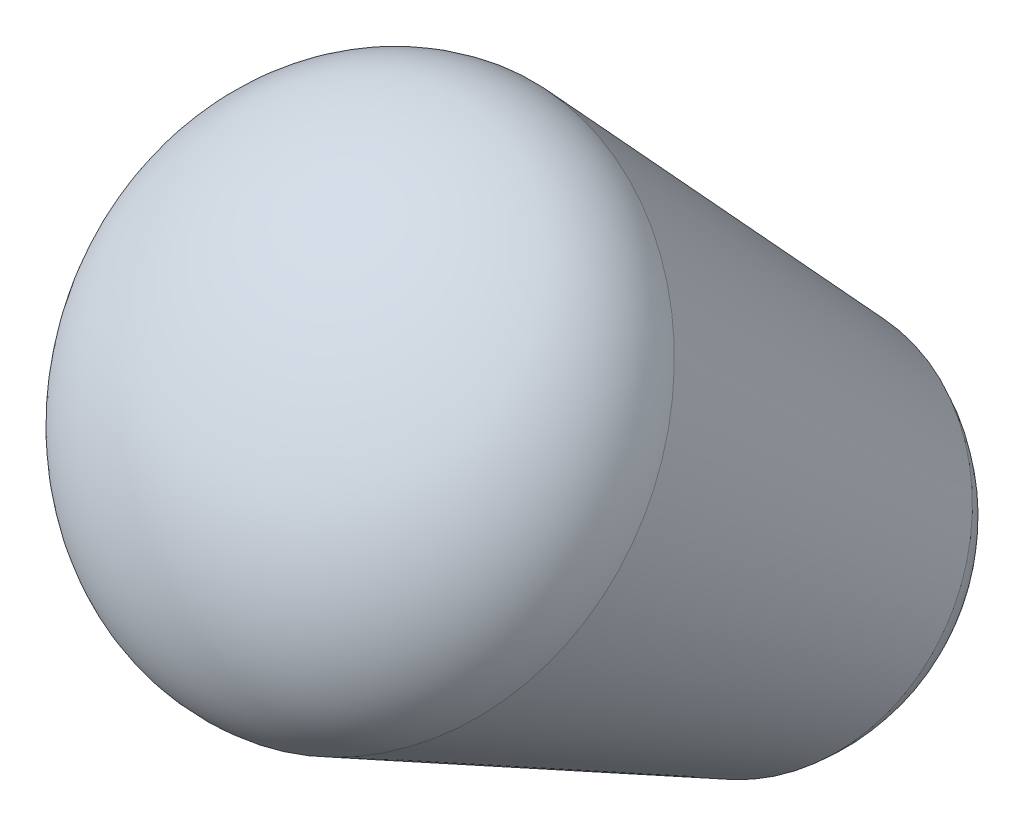
ISO-10303-21;
HEADER;
FILE_DESCRIPTION(('STEP AP214'),'2;1');
FILE_NAME('part.step','',(''),(''),'','','');
FILE_SCHEMA(('AUTOMOTIVE_DESIGN { 1 0 10303 214 1 1 1 1 }'));
ENDSEC;
DATA;
#1=APPLICATION_CONTEXT('core data for automotive mechanical design processes');
#2=APPLICATION_PROTOCOL_DEFINITION('international standard','automotive_design',2000,#1);
#3=PRODUCT_CONTEXT('',#1,'mechanical');
#4=PRODUCT('Part','Part','',(#3));
#5=PRODUCT_RELATED_PRODUCT_CATEGORY('part','',(#4));
#6=PRODUCT_DEFINITION_FORMATION('','',#4);
#7=PRODUCT_DEFINITION_CONTEXT('part definition',#1,'design');
#8=PRODUCT_DEFINITION('design','',#6,#7);
#9=PRODUCT_DEFINITION_SHAPE('','',#8);
#10=(LENGTH_UNIT() NAMED_UNIT(*) SI_UNIT(.MILLI.,.METRE.));
#11=(NAMED_UNIT(*) PLANE_ANGLE_UNIT() SI_UNIT($,.RADIAN.));
#12=(NAMED_UNIT(*) SI_UNIT($,.STERADIAN.) SOLID_ANGLE_UNIT());
#13=UNCERTAINTY_MEASURE_WITH_UNIT(LENGTH_MEASURE(1.E-05),#10,'distance_accuracy_value','');
#14=(GEOMETRIC_REPRESENTATION_CONTEXT(3) GLOBAL_UNCERTAINTY_ASSIGNED_CONTEXT((#13)) GLOBAL_UNIT_ASSIGNED_CONTEXT((#10,
#11,#12)) REPRESENTATION_CONTEXT('',''));
#15=CARTESIAN_POINT('',(0.,0.,0.));
#16=DIRECTION('',(0.,0.,1.));
#17=DIRECTION('',(1.,0.,0.));
#18=AXIS2_PLACEMENT_3D('',#15,#16,#17);
#19=CARTESIAN_POINT('',(0.,-51.695936182814,-126.44134630734));
#20=DIRECTION('',(0.,0.621249127876115,0.783613119538696));
#21=DIRECTION('',(0.,-0.783613119538696,0.621249127876115));
#22=AXIS2_PLACEMENT_3D('',#19,#20,#21);
#23=CONICAL_SURFACE('',#22,15.,0.15707963267949);
#24=CARTESIAN_POINT('',(0.,-69.9444279441784,-149.459097020143));
#25=DIRECTION('',(0.,0.621249127876115,0.783613119538696));
#26=DIRECTION('',(0.,-0.783613119538696,0.621249127876115));
#27=AXIS2_PLACEMENT_3D('',#24,#25,#26);
#28=CIRCLE('',#27,10.3476358763324);
#29=CARTESIAN_POINT('',(0.,-78.0529711730818,-143.030637256392));
#30=VERTEX_POINT('',#29);
#31=EDGE_CURVE('E11',#30,#30,#28,.T.);
#32=ORIENTED_EDGE('',*,*,#31,.T.);
#33=EDGE_LOOP('',(#32));
#34=FACE_BOUND('',#33,.T.);
#35=CARTESIAN_POINT('',(0.,-51.695936182814,-126.44134630734));
#36=DIRECTION('',(0.,0.621249127876115,0.783613119538696));
#37=DIRECTION('',(0.,-0.783613119538696,0.621249127876115));
#38=AXIS2_PLACEMENT_3D('',#35,#36,#37);
#39=CIRCLE('',#38,15.);
#40=CARTESIAN_POINT('',(0.,-63.4501329758944,-117.122609389198));
#41=VERTEX_POINT('',#40);
#42=EDGE_CURVE('E43',#41,#41,#39,.T.);
#43=ORIENTED_EDGE('',*,*,#42,.F.);
#44=EDGE_LOOP('',(#43));
#45=FACE_BOUND('',#44,.T.);
#46=ADVANCED_FACE('F36',(#34,#45),#23,.T.);
#47=CARTESIAN_POINT('',(0.,-67.367416971677,-146.2085820228));
#48=DIRECTION('',(0.,0.,1.));
#49=DIRECTION('',(1.,0.,0.));
#50=AXIS2_PLACEMENT_3D('',#47,#48,#49);
#51=SPHERICAL_SURFACE('',#50,11.1481120163687);
#52=CARTESIAN_POINT('',(0.,-67.367416971677,-146.2085820228));
#53=DIRECTION('',(0.,0.621249127876115,0.783613119538696));
#54=DIRECTION('',(0.,-0.783613119538696,0.621249127876115));
#55=AXIS2_PLACEMENT_3D('',#52,#53,#54);
#56=SPHERICAL_SURFACE('',#55,11.1481120163687);
#57=ORIENTED_EDGE('',*,*,#31,.F.);
#58=EDGE_LOOP('',(#57));
#59=FACE_BOUND('',#58,.T.);
#60=ADVANCED_FACE('F38',(#59),#56,.T.);
#61=CARTESIAN_POINT('',(0.,-51.695936182814,-126.44134630734));
#62=DIRECTION('',(1.,0.,0.));
#63=DIRECTION('',(0.,-0.783613119538696,0.621249127876115));
#64=AXIS2_PLACEMENT_3D('',#61,#62,#63);
#65=ELLIPSE('',#64,15.,10.);
#66=TRIMMED_CURVE('',#65,(PARAMETER_VALUE(4.71238898038469)),
(PARAMETER_VALUE(7.85398163397448)),.T.,.PARAMETER.);
#67=CARTESIAN_POINT('',(0.,-57.9084274615751,-134.277477502726));
#68=DIRECTION('',(0.,0.621249127876114,0.783613119538696));
#69=AXIS1_PLACEMENT('',#67,#68);
#70=SURFACE_OF_REVOLUTION('',#66,#69);
#71=CARTESIAN_POINT('',(0.,-45.4834449040528,-118.605215111953));
#72=VERTEX_POINT('',#71);
#73=VERTEX_LOOP('',#72);
#74=FACE_BOUND('',#73,.T.);
#75=ORIENTED_EDGE('',*,*,#42,.T.);
#76=EDGE_LOOP('',(#75));
#77=FACE_BOUND('',#76,.T.);
#78=ADVANCED_FACE('F46',(#74,#77),#70,.F.);
#79=CLOSED_SHELL('',(#46,#60,#78));
#80=MANIFOLD_SOLID_BREP('B2',#79);
#81=ADVANCED_BREP_SHAPE_REPRESENTATION('',(#18,#80),#14);
#82=SHAPE_DEFINITION_REPRESENTATION(#9,#81);
ENDSEC;
END-ISO-10303-21;
